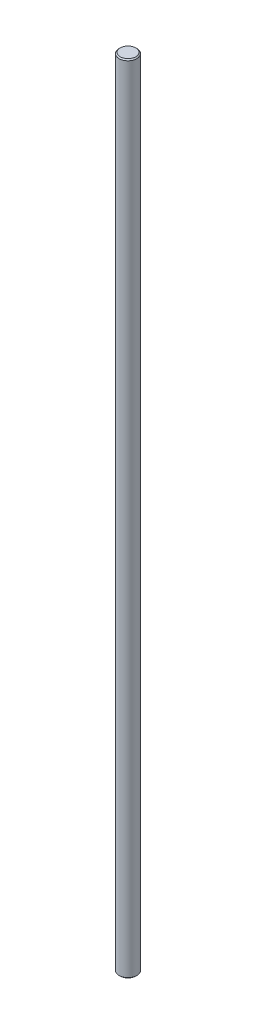
ISO-10303-21;
HEADER;
FILE_DESCRIPTION(('STEP AP214'),'2;1');
FILE_NAME('part.step','',(''),(''),'','','');
FILE_SCHEMA(('AUTOMOTIVE_DESIGN { 1 0 10303 214 1 1 1 1 }'));
ENDSEC;
DATA;
#1=APPLICATION_CONTEXT('core data for automotive mechanical design processes');
#2=APPLICATION_PROTOCOL_DEFINITION('international standard','automotive_design',2000,#1);
#3=PRODUCT_CONTEXT('',#1,'mechanical');
#4=PRODUCT('Part','Part','',(#3));
#5=PRODUCT_RELATED_PRODUCT_CATEGORY('part','',(#4));
#6=PRODUCT_DEFINITION_FORMATION('','',#4);
#7=PRODUCT_DEFINITION_CONTEXT('part definition',#1,'design');
#8=PRODUCT_DEFINITION('design','',#6,#7);
#9=PRODUCT_DEFINITION_SHAPE('','',#8);
#10=(LENGTH_UNIT() NAMED_UNIT(*) SI_UNIT(.MILLI.,.METRE.));
#11=(NAMED_UNIT(*) PLANE_ANGLE_UNIT() SI_UNIT($,.RADIAN.));
#12=(NAMED_UNIT(*) SI_UNIT($,.STERADIAN.) SOLID_ANGLE_UNIT());
#13=UNCERTAINTY_MEASURE_WITH_UNIT(LENGTH_MEASURE(1.E-05),#10,'distance_accuracy_value','');
#14=(GEOMETRIC_REPRESENTATION_CONTEXT(3) GLOBAL_UNCERTAINTY_ASSIGNED_CONTEXT((#13)) GLOBAL_UNIT_ASSIGNED_CONTEXT((#10,
#11,#12)) REPRESENTATION_CONTEXT('',''));
#15=CARTESIAN_POINT('',(0.,0.,0.));
#16=DIRECTION('',(0.,0.,1.));
#17=DIRECTION('',(1.,0.,0.));
#18=AXIS2_PLACEMENT_3D('',#15,#16,#17);
#19=CARTESIAN_POINT('',(0.,-180.,0.));
#20=DIRECTION('',(0.,1.,0.));
#21=DIRECTION('',(0.,0.,1.));
#22=AXIS2_PLACEMENT_3D('',#19,#20,#21);
#23=CYLINDRICAL_SURFACE('',#22,4.);
#24=CARTESIAN_POINT('',(0.,-179.5,0.));
#25=DIRECTION('',(0.,1.,0.));
#26=DIRECTION('',(0.,0.,1.));
#27=AXIS2_PLACEMENT_3D('',#24,#25,#26);
#28=CIRCLE('',#27,4.);
#29=CARTESIAN_POINT('',(0.,-179.5,4.));
#30=VERTEX_POINT('',#29);
#31=EDGE_CURVE('E45',#30,#30,#28,.T.);
#32=ORIENTED_EDGE('',*,*,#31,.T.);
#33=EDGE_LOOP('',(#32));
#34=FACE_BOUND('',#33,.T.);
#35=CARTESIAN_POINT('',(0.,179.5,0.));
#36=DIRECTION('',(0.,1.,0.));
#37=DIRECTION('',(0.,0.,1.));
#38=AXIS2_PLACEMENT_3D('',#35,#36,#37);
#39=CIRCLE('',#38,4.);
#40=CARTESIAN_POINT('',(0.,179.5,4.));
#41=VERTEX_POINT('',#40);
#42=EDGE_CURVE('E49',#41,#41,#39,.F.);
#43=ORIENTED_EDGE('',*,*,#42,.T.);
#44=EDGE_LOOP('',(#43));
#45=FACE_BOUND('',#44,.T.);
#46=ADVANCED_FACE('F33',(#34,#45),#23,.T.);
#47=CARTESIAN_POINT('',(0.,-180.,0.));
#48=DIRECTION('',(0.,1.,0.));
#49=DIRECTION('',(0.,0.,1.));
#50=AXIS2_PLACEMENT_3D('',#47,#48,#49);
#51=PLANE('',#50);
#52=CARTESIAN_POINT('',(0.,-180.,0.));
#53=DIRECTION('',(0.,1.,0.));
#54=DIRECTION('',(0.,0.,1.));
#55=AXIS2_PLACEMENT_3D('',#52,#53,#54);
#56=CIRCLE('',#55,3.49999999999984);
#57=CARTESIAN_POINT('',(0.,-180.,3.49999999999984));
#58=VERTEX_POINT('',#57);
#59=EDGE_CURVE('E41',#58,#58,#56,.F.);
#60=ORIENTED_EDGE('',*,*,#59,.T.);
#61=EDGE_LOOP('',(#60));
#62=FACE_BOUND('',#61,.T.);
#63=ADVANCED_FACE('F65',(#62),#51,.F.);
#64=CARTESIAN_POINT('',(0.,180.,0.));
#65=DIRECTION('',(0.,1.,0.));
#66=DIRECTION('',(0.,0.,1.));
#67=AXIS2_PLACEMENT_3D('',#64,#65,#66);
#68=PLANE('',#67);
#69=CARTESIAN_POINT('',(0.,180.,0.));
#70=DIRECTION('',(0.,1.,0.));
#71=DIRECTION('',(0.,0.,1.));
#72=AXIS2_PLACEMENT_3D('',#69,#70,#71);
#73=CIRCLE('',#72,3.5);
#74=CARTESIAN_POINT('',(0.,180.,3.5));
#75=VERTEX_POINT('',#74);
#76=EDGE_CURVE('E10',#75,#75,#73,.T.);
#77=ORIENTED_EDGE('',*,*,#76,.T.);
#78=EDGE_LOOP('',(#77));
#79=FACE_BOUND('',#78,.T.);
#80=ADVANCED_FACE('F62',(#79),#68,.T.);
#81=CARTESIAN_POINT('',(0.,-179.5,0.));
#82=DIRECTION('',(0.,1.,0.));
#83=DIRECTION('',(0.,0.,1.));
#84=AXIS2_PLACEMENT_3D('',#81,#82,#83);
#85=CONICAL_SURFACE('',#84,4.,0.785398163397446);
#86=ORIENTED_EDGE('',*,*,#59,.F.);
#87=EDGE_LOOP('',(#86));
#88=FACE_BOUND('',#87,.T.);
#89=ORIENTED_EDGE('',*,*,#31,.F.);
#90=EDGE_LOOP('',(#89));
#91=FACE_BOUND('',#90,.T.);
#92=ADVANCED_FACE('F58',(#88,#91),#85,.T.);
#93=CARTESIAN_POINT('',(0.,180.,0.));
#94=DIRECTION('',(0.,-1.,0.));
#95=DIRECTION('',(0.,0.,-1.));
#96=AXIS2_PLACEMENT_3D('',#93,#94,#95);
#97=CONICAL_SURFACE('',#96,3.5,0.785398163397501);
#98=ORIENTED_EDGE('',*,*,#42,.F.);
#99=EDGE_LOOP('',(#98));
#100=FACE_BOUND('',#99,.T.);
#101=ORIENTED_EDGE('',*,*,#76,.F.);
#102=EDGE_LOOP('',(#101));
#103=FACE_BOUND('',#102,.T.);
#104=ADVANCED_FACE('F36',(#100,#103),#97,.T.);
#105=CLOSED_SHELL('',(#46,#63,#80,#92,#104));
#106=MANIFOLD_SOLID_BREP('B2',#105);
#107=ADVANCED_BREP_SHAPE_REPRESENTATION('',(#18,#106),#14);
#108=SHAPE_DEFINITION_REPRESENTATION(#9,#107);
ENDSEC;
END-ISO-10303-21;
